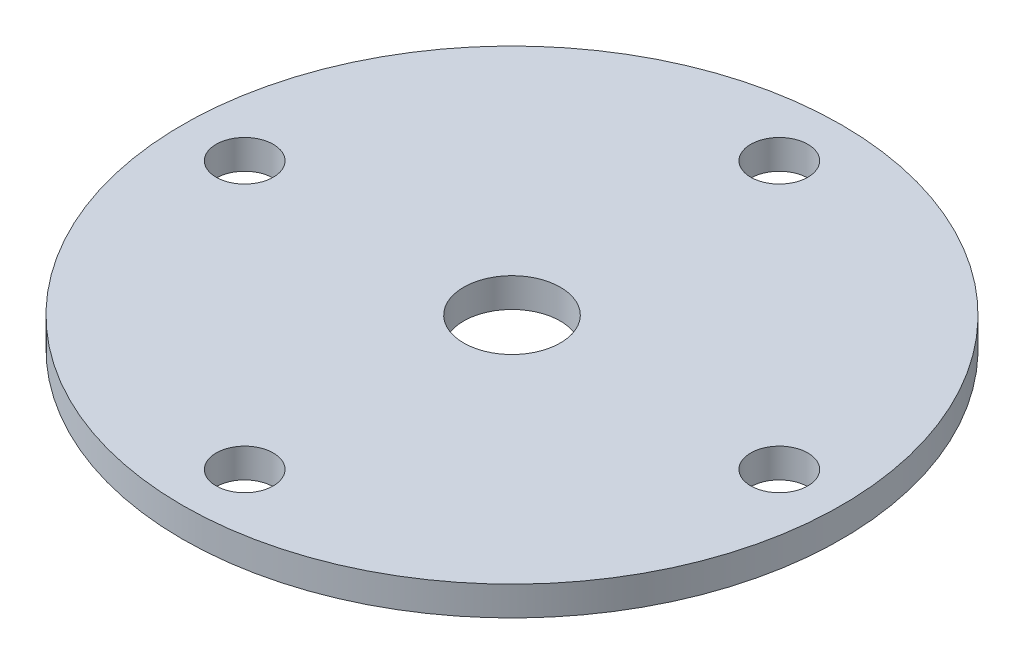
ISO-10303-21;
HEADER;
FILE_DESCRIPTION(('STEP AP214'),'2;1');
FILE_NAME('part.step','',(''),(''),'','','');
FILE_SCHEMA(('AUTOMOTIVE_DESIGN { 1 0 10303 214 1 1 1 1 }'));
ENDSEC;
DATA;
#1=APPLICATION_CONTEXT('core data for automotive mechanical design processes');
#2=APPLICATION_PROTOCOL_DEFINITION('international standard','automotive_design',2000,#1);
#3=PRODUCT_CONTEXT('',#1,'mechanical');
#4=PRODUCT('Part','Part','',(#3));
#5=PRODUCT_RELATED_PRODUCT_CATEGORY('part','',(#4));
#6=PRODUCT_DEFINITION_FORMATION('','',#4);
#7=PRODUCT_DEFINITION_CONTEXT('part definition',#1,'design');
#8=PRODUCT_DEFINITION('design','',#6,#7);
#9=PRODUCT_DEFINITION_SHAPE('','',#8);
#10=(LENGTH_UNIT() NAMED_UNIT(*) SI_UNIT(.MILLI.,.METRE.));
#11=(NAMED_UNIT(*) PLANE_ANGLE_UNIT() SI_UNIT($,.RADIAN.));
#12=(NAMED_UNIT(*) SI_UNIT($,.STERADIAN.) SOLID_ANGLE_UNIT());
#13=UNCERTAINTY_MEASURE_WITH_UNIT(LENGTH_MEASURE(1.E-05),#10,'distance_accuracy_value','');
#14=(GEOMETRIC_REPRESENTATION_CONTEXT(3) GLOBAL_UNCERTAINTY_ASSIGNED_CONTEXT((#13)) GLOBAL_UNIT_ASSIGNED_CONTEXT((#10,
#11,#12)) REPRESENTATION_CONTEXT('',''));
#15=CARTESIAN_POINT('',(0.,0.,0.));
#16=DIRECTION('',(0.,0.,1.));
#17=DIRECTION('',(1.,0.,0.));
#18=AXIS2_PLACEMENT_3D('',#15,#16,#17);
#19=CARTESIAN_POINT('',(0.,3.,0.));
#20=DIRECTION('',(0.,1.,0.));
#21=DIRECTION('',(0.,0.,1.));
#22=AXIS2_PLACEMENT_3D('',#19,#20,#21);
#23=PLANE('',#22);
#24=CARTESIAN_POINT('',(0.,3.,27.375));
#25=DIRECTION('',(0.,1.,0.));
#26=DIRECTION('',(0.,0.,1.));
#27=AXIS2_PLACEMENT_3D('',#24,#25,#26);
#28=CIRCLE('',#27,2.925);
#29=CARTESIAN_POINT('',(0.,3.,30.3));
#30=VERTEX_POINT('',#29);
#31=EDGE_CURVE('E63',#30,#30,#28,.T.);
#32=ORIENTED_EDGE('',*,*,#31,.F.);
#33=EDGE_LOOP('',(#32));
#34=FACE_BOUND('',#33,.T.);
#35=CARTESIAN_POINT('',(0.,3.,-27.375));
#36=DIRECTION('',(0.,1.,0.));
#37=DIRECTION('',(0.,0.,1.));
#38=AXIS2_PLACEMENT_3D('',#35,#36,#37);
#39=CIRCLE('',#38,2.925);
#40=CARTESIAN_POINT('',(0.,3.,-24.45));
#41=VERTEX_POINT('',#40);
#42=EDGE_CURVE('E51',#41,#41,#39,.T.);
#43=ORIENTED_EDGE('',*,*,#42,.F.);
#44=EDGE_LOOP('',(#43));
#45=FACE_BOUND('',#44,.T.);
#46=CARTESIAN_POINT('',(0.,3.,0.));
#47=DIRECTION('',(0.,1.,0.));
#48=DIRECTION('',(0.,0.,1.));
#49=AXIS2_PLACEMENT_3D('',#46,#47,#48);
#50=CIRCLE('',#49,33.75);
#51=CARTESIAN_POINT('',(0.,3.,33.75));
#52=VERTEX_POINT('',#51);
#53=EDGE_CURVE('E10',#52,#52,#50,.T.);
#54=ORIENTED_EDGE('',*,*,#53,.T.);
#55=EDGE_LOOP('',(#54));
#56=FACE_BOUND('',#55,.T.);
#57=CARTESIAN_POINT('',(0.,3.,0.));
#58=DIRECTION('',(0.,1.,0.));
#59=DIRECTION('',(0.,0.,1.));
#60=AXIS2_PLACEMENT_3D('',#57,#58,#59);
#61=CIRCLE('',#60,4.95);
#62=CARTESIAN_POINT('',(0.,3.,4.95));
#63=VERTEX_POINT('',#62);
#64=EDGE_CURVE('E46',#63,#63,#61,.T.);
#65=ORIENTED_EDGE('',*,*,#64,.F.);
#66=EDGE_LOOP('',(#65));
#67=FACE_BOUND('',#66,.T.);
#68=CARTESIAN_POINT('',(27.375,3.,0.));
#69=DIRECTION('',(0.,1.,0.));
#70=DIRECTION('',(0.,0.,1.));
#71=AXIS2_PLACEMENT_3D('',#68,#69,#70);
#72=CIRCLE('',#71,2.925);
#73=CARTESIAN_POINT('',(27.375,3.,2.925));
#74=VERTEX_POINT('',#73);
#75=EDGE_CURVE('E57',#74,#74,#72,.T.);
#76=ORIENTED_EDGE('',*,*,#75,.F.);
#77=EDGE_LOOP('',(#76));
#78=FACE_BOUND('',#77,.T.);
#79=CARTESIAN_POINT('',(-27.375,3.,0.));
#80=DIRECTION('',(0.,1.,0.));
#81=DIRECTION('',(0.,0.,1.));
#82=AXIS2_PLACEMENT_3D('',#79,#80,#81);
#83=CIRCLE('',#82,2.925);
#84=CARTESIAN_POINT('',(-27.375,3.,2.925));
#85=VERTEX_POINT('',#84);
#86=EDGE_CURVE('E69',#85,#85,#83,.T.);
#87=ORIENTED_EDGE('',*,*,#86,.F.);
#88=EDGE_LOOP('',(#87));
#89=FACE_BOUND('',#88,.T.);
#90=ADVANCED_FACE('F35',(#34,#45,#56,#67,#78,#89),#23,.T.);
#91=CARTESIAN_POINT('',(0.,0.,0.));
#92=DIRECTION('',(0.,1.,0.));
#93=DIRECTION('',(0.,0.,1.));
#94=AXIS2_PLACEMENT_3D('',#91,#92,#93);
#95=PLANE('',#94);
#96=CARTESIAN_POINT('',(0.,0.,0.));
#97=DIRECTION('',(0.,1.,0.));
#98=DIRECTION('',(0.,0.,1.));
#99=AXIS2_PLACEMENT_3D('',#96,#97,#98);
#100=CIRCLE('',#99,33.75);
#101=CARTESIAN_POINT('',(0.,0.,33.75));
#102=VERTEX_POINT('',#101);
#103=EDGE_CURVE('E39',#102,#102,#100,.T.);
#104=ORIENTED_EDGE('',*,*,#103,.F.);
#105=EDGE_LOOP('',(#104));
#106=FACE_BOUND('',#105,.T.);
#107=CARTESIAN_POINT('',(0.,0.,0.));
#108=DIRECTION('',(0.,1.,0.));
#109=DIRECTION('',(0.,0.,1.));
#110=AXIS2_PLACEMENT_3D('',#107,#108,#109);
#111=CIRCLE('',#110,4.95);
#112=CARTESIAN_POINT('',(0.,0.,4.95));
#113=VERTEX_POINT('',#112);
#114=EDGE_CURVE('E48',#113,#113,#111,.T.);
#115=ORIENTED_EDGE('',*,*,#114,.T.);
#116=EDGE_LOOP('',(#115));
#117=FACE_BOUND('',#116,.T.);
#118=CARTESIAN_POINT('',(0.,0.,-27.375));
#119=DIRECTION('',(0.,1.,0.));
#120=DIRECTION('',(0.,0.,1.));
#121=AXIS2_PLACEMENT_3D('',#118,#119,#120);
#122=CIRCLE('',#121,2.925);
#123=CARTESIAN_POINT('',(0.,0.,-24.45));
#124=VERTEX_POINT('',#123);
#125=EDGE_CURVE('E54',#124,#124,#122,.T.);
#126=ORIENTED_EDGE('',*,*,#125,.T.);
#127=EDGE_LOOP('',(#126));
#128=FACE_BOUND('',#127,.T.);
#129=CARTESIAN_POINT('',(27.375,0.,0.));
#130=DIRECTION('',(0.,1.,0.));
#131=DIRECTION('',(0.,0.,1.));
#132=AXIS2_PLACEMENT_3D('',#129,#130,#131);
#133=CIRCLE('',#132,2.925);
#134=CARTESIAN_POINT('',(27.375,0.,2.925));
#135=VERTEX_POINT('',#134);
#136=EDGE_CURVE('E60',#135,#135,#133,.T.);
#137=ORIENTED_EDGE('',*,*,#136,.T.);
#138=EDGE_LOOP('',(#137));
#139=FACE_BOUND('',#138,.T.);
#140=CARTESIAN_POINT('',(0.,0.,27.375));
#141=DIRECTION('',(0.,1.,0.));
#142=DIRECTION('',(0.,0.,1.));
#143=AXIS2_PLACEMENT_3D('',#140,#141,#142);
#144=CIRCLE('',#143,2.925);
#145=CARTESIAN_POINT('',(0.,0.,30.3));
#146=VERTEX_POINT('',#145);
#147=EDGE_CURVE('E66',#146,#146,#144,.T.);
#148=ORIENTED_EDGE('',*,*,#147,.T.);
#149=EDGE_LOOP('',(#148));
#150=FACE_BOUND('',#149,.T.);
#151=CARTESIAN_POINT('',(-27.375,0.,0.));
#152=DIRECTION('',(0.,1.,0.));
#153=DIRECTION('',(0.,0.,1.));
#154=AXIS2_PLACEMENT_3D('',#151,#152,#153);
#155=CIRCLE('',#154,2.925);
#156=CARTESIAN_POINT('',(-27.375,0.,2.925));
#157=VERTEX_POINT('',#156);
#158=EDGE_CURVE('E72',#157,#157,#155,.T.);
#159=ORIENTED_EDGE('',*,*,#158,.T.);
#160=EDGE_LOOP('',(#159));
#161=FACE_BOUND('',#160,.T.);
#162=ADVANCED_FACE('F82',(#106,#117,#128,#139,#150,#161),#95,.F.);
#163=CARTESIAN_POINT('',(0.,3.,0.));
#164=DIRECTION('',(0.,-1.,0.));
#165=DIRECTION('',(0.,0.,-1.));
#166=AXIS2_PLACEMENT_3D('',#163,#164,#165);
#167=CYLINDRICAL_SURFACE('',#166,33.75);
#168=ORIENTED_EDGE('',*,*,#53,.F.);
#169=EDGE_LOOP('',(#168));
#170=FACE_BOUND('',#169,.T.);
#171=ORIENTED_EDGE('',*,*,#103,.T.);
#172=EDGE_LOOP('',(#171));
#173=FACE_BOUND('',#172,.T.);
#174=ADVANCED_FACE('F37',(#170,#173),#167,.T.);
#175=CARTESIAN_POINT('',(0.,3.,0.));
#176=DIRECTION('',(0.,-1.,0.));
#177=DIRECTION('',(0.,0.,-1.));
#178=AXIS2_PLACEMENT_3D('',#175,#176,#177);
#179=CYLINDRICAL_SURFACE('',#178,4.95);
#180=ORIENTED_EDGE('',*,*,#64,.T.);
#181=EDGE_LOOP('',(#180));
#182=FACE_BOUND('',#181,.T.);
#183=ORIENTED_EDGE('',*,*,#114,.F.);
#184=EDGE_LOOP('',(#183));
#185=FACE_BOUND('',#184,.T.);
#186=ADVANCED_FACE('F92',(#182,#185),#179,.F.);
#187=CARTESIAN_POINT('',(0.,3.,-27.375));
#188=DIRECTION('',(0.,-1.,0.));
#189=DIRECTION('',(0.,0.,-1.));
#190=AXIS2_PLACEMENT_3D('',#187,#188,#189);
#191=CYLINDRICAL_SURFACE('',#190,2.925);
#192=ORIENTED_EDGE('',*,*,#42,.T.);
#193=EDGE_LOOP('',(#192));
#194=FACE_BOUND('',#193,.T.);
#195=ORIENTED_EDGE('',*,*,#125,.F.);
#196=EDGE_LOOP('',(#195));
#197=FACE_BOUND('',#196,.T.);
#198=ADVANCED_FACE('F95',(#194,#197),#191,.F.);
#199=CARTESIAN_POINT('',(27.375,3.,0.));
#200=DIRECTION('',(0.,-1.,0.));
#201=DIRECTION('',(0.,0.,-1.));
#202=AXIS2_PLACEMENT_3D('',#199,#200,#201);
#203=CYLINDRICAL_SURFACE('',#202,2.925);
#204=ORIENTED_EDGE('',*,*,#75,.T.);
#205=EDGE_LOOP('',(#204));
#206=FACE_BOUND('',#205,.T.);
#207=ORIENTED_EDGE('',*,*,#136,.F.);
#208=EDGE_LOOP('',(#207));
#209=FACE_BOUND('',#208,.T.);
#210=ADVANCED_FACE('F99',(#206,#209),#203,.F.);
#211=CARTESIAN_POINT('',(0.,3.,27.375));
#212=DIRECTION('',(0.,-1.,0.));
#213=DIRECTION('',(0.,0.,-1.));
#214=AXIS2_PLACEMENT_3D('',#211,#212,#213);
#215=CYLINDRICAL_SURFACE('',#214,2.925);
#216=ORIENTED_EDGE('',*,*,#31,.T.);
#217=EDGE_LOOP('',(#216));
#218=FACE_BOUND('',#217,.T.);
#219=ORIENTED_EDGE('',*,*,#147,.F.);
#220=EDGE_LOOP('',(#219));
#221=FACE_BOUND('',#220,.T.);
#222=ADVANCED_FACE('F103',(#218,#221),#215,.F.);
#223=CARTESIAN_POINT('',(-27.375,3.,0.));
#224=DIRECTION('',(0.,-1.,0.));
#225=DIRECTION('',(0.,0.,-1.));
#226=AXIS2_PLACEMENT_3D('',#223,#224,#225);
#227=CYLINDRICAL_SURFACE('',#226,2.925);
#228=ORIENTED_EDGE('',*,*,#86,.T.);
#229=EDGE_LOOP('',(#228));
#230=FACE_BOUND('',#229,.T.);
#231=ORIENTED_EDGE('',*,*,#158,.F.);
#232=EDGE_LOOP('',(#231));
#233=FACE_BOUND('',#232,.T.);
#234=ADVANCED_FACE('F78',(#230,#233),#227,.F.);
#235=CLOSED_SHELL('',(#90,#162,#174,#186,#198,#210,#222,#234));
#236=MANIFOLD_SOLID_BREP('B2',#235);
#237=ADVANCED_BREP_SHAPE_REPRESENTATION('',(#18,#236),#14);
#238=SHAPE_DEFINITION_REPRESENTATION(#9,#237);
ENDSEC;
END-ISO-10303-21;
